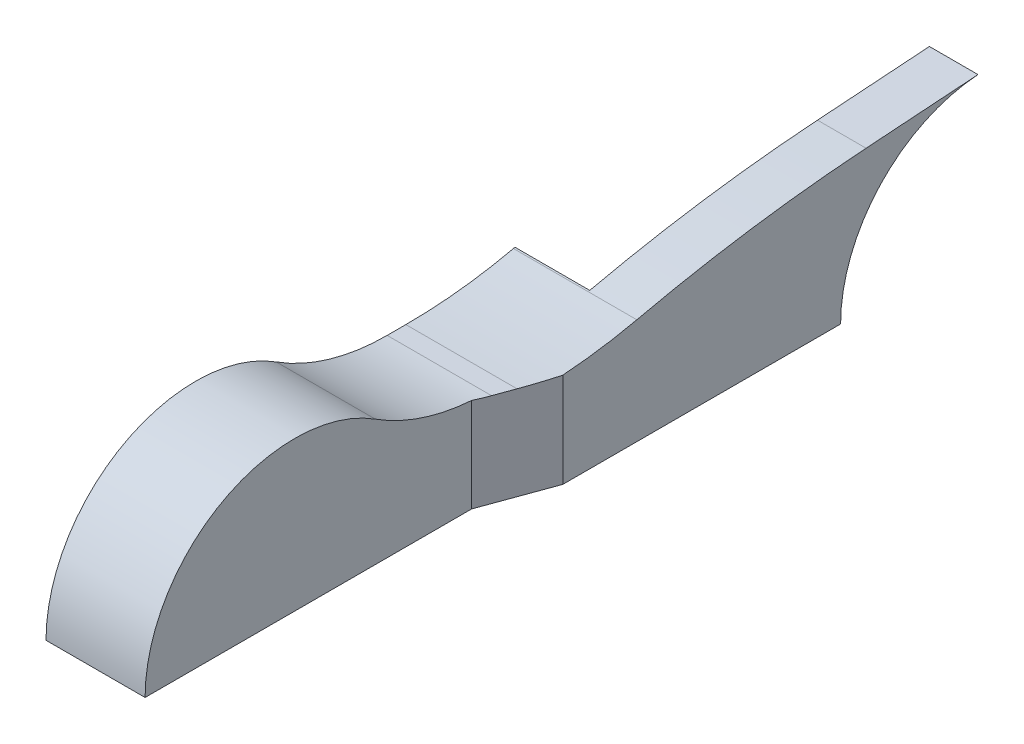
ISO-10303-21;
HEADER;
FILE_DESCRIPTION(('STEP AP214'),'2;1');
FILE_NAME('part.step','',(''),(''),'','','');
FILE_SCHEMA(('AUTOMOTIVE_DESIGN { 1 0 10303 214 1 1 1 1 }'));
ENDSEC;
DATA;
#1=APPLICATION_CONTEXT('core data for automotive mechanical design processes');
#2=APPLICATION_PROTOCOL_DEFINITION('international standard','automotive_design',2000,#1);
#3=PRODUCT_CONTEXT('',#1,'mechanical');
#4=PRODUCT('Part','Part','',(#3));
#5=PRODUCT_RELATED_PRODUCT_CATEGORY('part','',(#4));
#6=PRODUCT_DEFINITION_FORMATION('','',#4);
#7=PRODUCT_DEFINITION_CONTEXT('part definition',#1,'design');
#8=PRODUCT_DEFINITION('design','',#6,#7);
#9=PRODUCT_DEFINITION_SHAPE('','',#8);
#10=(LENGTH_UNIT() NAMED_UNIT(*) SI_UNIT(.MILLI.,.METRE.));
#11=(NAMED_UNIT(*) PLANE_ANGLE_UNIT() SI_UNIT($,.RADIAN.));
#12=(NAMED_UNIT(*) SI_UNIT($,.STERADIAN.) SOLID_ANGLE_UNIT());
#13=UNCERTAINTY_MEASURE_WITH_UNIT(LENGTH_MEASURE(1.E-05),#10,'distance_accuracy_value','');
#14=(GEOMETRIC_REPRESENTATION_CONTEXT(3) GLOBAL_UNCERTAINTY_ASSIGNED_CONTEXT((#13)) GLOBAL_UNIT_ASSIGNED_CONTEXT((#10,
#11,#12)) REPRESENTATION_CONTEXT('',''));
#15=CARTESIAN_POINT('',(0.,0.,0.));
#16=DIRECTION('',(0.,0.,1.));
#17=DIRECTION('',(1.,0.,0.));
#18=AXIS2_PLACEMENT_3D('',#15,#16,#17);
#19=CARTESIAN_POINT('',(26.5,0.,0.));
#20=DIRECTION('',(1.,0.,0.));
#21=DIRECTION('',(0.,0.,-1.));
#22=AXIS2_PLACEMENT_3D('',#19,#20,#21);
#23=PLANE('',#22);
#24=DIRECTION('',(0.,-1.,0.));
#25=VECTOR('',#24,1.);
#26=CARTESIAN_POINT('',(26.5,40.,-47.3393967735451));
#27=LINE('',#26,#25);
#28=CARTESIAN_POINT('',(26.5,25.1381171175806,-47.3393967735451));
#29=VERTEX_POINT('',#28);
#30=CARTESIAN_POINT('',(26.5,0.,-47.3393967735451));
#31=VERTEX_POINT('',#30);
#32=EDGE_CURVE('E230',#29,#31,#27,.T.);
#33=ORIENTED_EDGE('',*,*,#32,.F.);
#34=CARTESIAN_POINT('',(26.5,80.,-51.234753829798));
#35=DIRECTION('',(1.,0.,0.));
#36=DIRECTION('',(0.,0.,-1.));
#37=AXIS2_PLACEMENT_3D('',#34,#35,#36);
#38=CIRCLE('',#37,55.);
#39=CARTESIAN_POINT('',(26.5,33.6842105263158,-21.572527928336));
#40=VERTEX_POINT('',#39);
#41=EDGE_CURVE('E202',#29,#40,#38,.F.);
#42=ORIENTED_EDGE('',*,*,#41,.T.);
#43=CARTESIAN_POINT('',(26.5,0.,0.));
#44=DIRECTION('',(1.,0.,0.));
#45=DIRECTION('',(0.,0.,-1.));
#46=AXIS2_PLACEMENT_3D('',#43,#44,#45);
#47=CIRCLE('',#46,40.);
#48=CARTESIAN_POINT('',(26.5,0.,40.));
#49=VERTEX_POINT('',#48);
#50=EDGE_CURVE('E153',#40,#49,#47,.T.);
#51=ORIENTED_EDGE('',*,*,#50,.T.);
#52=DIRECTION('',(0.,0.,-1.));
#53=VECTOR('',#52,1.);
#54=CARTESIAN_POINT('',(26.5,0.,0.));
#55=LINE('',#54,#53);
#56=CARTESIAN_POINT('',(26.5,0.,0.));
#57=VERTEX_POINT('',#56);
#58=EDGE_CURVE('E248',#49,#57,#55,.T.);
#59=ORIENTED_EDGE('',*,*,#58,.T.);
#60=DIRECTION('',(0.,-1.,0.));
#61=VECTOR('',#60,1.);
#62=CARTESIAN_POINT('',(26.5,40.,0.));
#63=LINE('',#62,#61);
#64=CARTESIAN_POINT('',(26.5,-1.2E-05,0.));
#65=VERTEX_POINT('',#64);
#66=EDGE_CURVE('E268',#57,#65,#63,.T.);
#67=ORIENTED_EDGE('',*,*,#66,.T.);
#68=DIRECTION('',(0.,0.,-1.));
#69=VECTOR('',#68,1.);
#70=CARTESIAN_POINT('',(26.5,-1.2E-05,0.));
#71=LINE('',#70,#69);
#72=EDGE_CURVE('E254',#65,#31,#71,.T.);
#73=ORIENTED_EDGE('',*,*,#72,.T.);
#74=EDGE_LOOP('',(#33,#42,#51,#59,#67,#73));
#75=FACE_BOUND('',#74,.T.);
#76=ADVANCED_FACE('F134',(#75),#23,.T.);
#77=CARTESIAN_POINT('',(0.,0.,0.));
#78=DIRECTION('',(1.,0.,0.));
#79=DIRECTION('',(0.,0.,-1.));
#80=AXIS2_PLACEMENT_3D('',#77,#78,#79);
#81=PLANE('',#80);
#82=CARTESIAN_POINT('',(0.,0.,0.));
#83=DIRECTION('',(1.,0.,0.));
#84=DIRECTION('',(0.,0.,-1.));
#85=AXIS2_PLACEMENT_3D('',#82,#83,#84);
#86=CIRCLE('',#85,40.);
#87=CARTESIAN_POINT('',(0.,33.6842105263158,-21.572527928336));
#88=VERTEX_POINT('',#87);
#89=CARTESIAN_POINT('',(0.,0.,40.));
#90=VERTEX_POINT('',#89);
#91=EDGE_CURVE('E358',#88,#90,#86,.T.);
#92=ORIENTED_EDGE('',*,*,#91,.F.);
#93=CARTESIAN_POINT('',(0.,80.,-51.234753829798));
#94=DIRECTION('',(1.,0.,0.));
#95=DIRECTION('',(0.,0.,-1.));
#96=AXIS2_PLACEMENT_3D('',#93,#94,#95);
#97=CIRCLE('',#96,55.);
#98=CARTESIAN_POINT('',(0.,25.,-51.234753829798));
#99=VERTEX_POINT('',#98);
#100=EDGE_CURVE('E201',#99,#88,#97,.F.);
#101=ORIENTED_EDGE('',*,*,#100,.F.);
#102=DIRECTION('',(0.,0.,-1.));
#103=VECTOR('',#102,1.);
#104=CARTESIAN_POINT('',(0.,25.,0.));
#105=LINE('',#104,#103);
#106=CARTESIAN_POINT('',(0.,25.,-56.234753829798));
#107=VERTEX_POINT('',#106);
#108=EDGE_CURVE('E138',#99,#107,#105,.T.);
#109=ORIENTED_EDGE('',*,*,#108,.T.);
#110=CARTESIAN_POINT('',(0.,154.46555360194,-56.234753829798));
#111=DIRECTION('',(1.,0.,0.));
#112=DIRECTION('',(0.,0.,-1.));
#113=AXIS2_PLACEMENT_3D('',#110,#111,#112);
#114=CIRCLE('',#113,129.46555360194);
#115=CARTESIAN_POINT('',(0.,28.2360396908721,-84.9999999999999));
#116=VERTEX_POINT('',#115);
#117=EDGE_CURVE('E176',#107,#116,#114,.T.);
#118=ORIENTED_EDGE('',*,*,#117,.T.);
#119=CARTESIAN_POINT('',(0.,-363.981977839457,-174.378842372769));
#120=DIRECTION('',(1.,0.,0.));
#121=DIRECTION('',(0.,0.,-1.));
#122=AXIS2_PLACEMENT_3D('',#119,#120,#121);
#123=CIRCLE('',#122,402.272980374419);
#124=CARTESIAN_POINT('',(0.,28.3303792047622,-85.415));
#125=VERTEX_POINT('',#124);
#126=EDGE_CURVE('E203',#125,#116,#123,.T.);
#127=ORIENTED_EDGE('',*,*,#126,.F.);
#128=DIRECTION('',(0.,-1.,0.));
#129=VECTOR('',#128,1.);
#130=CARTESIAN_POINT('',(0.,40.,-85.415));
#131=LINE('',#130,#129);
#132=CARTESIAN_POINT('',(0.,-1.2E-05,-85.415));
#133=VERTEX_POINT('',#132);
#134=EDGE_CURVE('E274',#125,#133,#131,.T.);
#135=ORIENTED_EDGE('',*,*,#134,.T.);
#136=DIRECTION('',(0.,0.,-1.));
#137=VECTOR('',#136,1.);
#138=CARTESIAN_POINT('',(0.,-1.2E-05,0.));
#139=LINE('',#138,#137);
#140=CARTESIAN_POINT('',(0.,-1.2E-05,0.));
#141=VERTEX_POINT('',#140);
#142=EDGE_CURVE('E244',#141,#133,#139,.T.);
#143=ORIENTED_EDGE('',*,*,#142,.F.);
#144=DIRECTION('',(0.,-1.,0.));
#145=VECTOR('',#144,1.);
#146=CARTESIAN_POINT('',(0.,40.,0.));
#147=LINE('',#146,#145);
#148=CARTESIAN_POINT('',(0.,0.,0.));
#149=VERTEX_POINT('',#148);
#150=EDGE_CURVE('E271',#149,#141,#147,.T.);
#151=ORIENTED_EDGE('',*,*,#150,.F.);
#152=DIRECTION('',(0.,0.,-1.));
#153=VECTOR('',#152,1.);
#154=CARTESIAN_POINT('',(0.,0.,0.));
#155=LINE('',#154,#153);
#156=EDGE_CURVE('E242',#90,#149,#155,.T.);
#157=ORIENTED_EDGE('',*,*,#156,.F.);
#158=EDGE_LOOP('',(#92,#101,#109,#118,#127,#135,#143,#151,#157));
#159=FACE_BOUND('',#158,.T.);
#160=ADVANCED_FACE('F200',(#159),#81,.F.);
#161=CARTESIAN_POINT('',(0.,-1.2E-05,0.));
#162=DIRECTION('',(0.,1.,0.));
#163=DIRECTION('',(0.,0.,1.));
#164=AXIS2_PLACEMENT_3D('',#161,#162,#163);
#165=PLANE('',#164);
#166=DIRECTION('',(-1.,0.,0.));
#167=VECTOR('',#166,1.);
#168=CARTESIAN_POINT('',(33.000055,-1.2E-05,-139.500000000002));
#169=LINE('',#168,#167);
#170=CARTESIAN_POINT('',(33.,-1.2E-05,-139.500000000002));
#171=VERTEX_POINT('',#170);
#172=CARTESIAN_POINT('',(20.,-1.2E-05,-139.500000000002));
#173=VERTEX_POINT('',#172);
#174=EDGE_CURVE('E311',#171,#173,#169,.T.);
#175=ORIENTED_EDGE('',*,*,#174,.F.);
#176=DIRECTION('',(0.,0.,-1.));
#177=VECTOR('',#176,1.);
#178=CARTESIAN_POINT('',(33.,-1.2E-05,0.));
#179=LINE('',#178,#177);
#180=CARTESIAN_POINT('',(33.,0.,-65.198));
#181=VERTEX_POINT('',#180);
#182=EDGE_CURVE('E231',#181,#171,#179,.T.);
#183=ORIENTED_EDGE('',*,*,#182,.F.);
#184=DIRECTION('',(0.34202014332567,0.,-0.939692620785908));
#185=VECTOR('',#184,1.);
#186=CARTESIAN_POINT('',(8.18550002329151,-1.2E-05,2.97927836106343));
#187=LINE('',#186,#185);
#188=EDGE_CURVE('E255',#31,#181,#187,.T.);
#189=ORIENTED_EDGE('',*,*,#188,.F.);
#190=ORIENTED_EDGE('',*,*,#72,.F.);
#191=DIRECTION('',(1.,0.,0.));
#192=VECTOR('',#191,1.);
#193=CARTESIAN_POINT('',(0.,-1.2E-05,0.));
#194=LINE('',#193,#192);
#195=EDGE_CURVE('E247',#141,#65,#194,.T.);
#196=ORIENTED_EDGE('',*,*,#195,.F.);
#197=ORIENTED_EDGE('',*,*,#142,.T.);
#198=DIRECTION('',(1.,0.,0.));
#199=VECTOR('',#198,1.);
#200=CARTESIAN_POINT('',(0.,-1.2E-05,-85.415));
#201=LINE('',#200,#199);
#202=CARTESIAN_POINT('',(20.,-1.2E-05,-85.415));
#203=VERTEX_POINT('',#202);
#204=EDGE_CURVE('E218',#133,#203,#201,.T.);
#205=ORIENTED_EDGE('',*,*,#204,.T.);
#206=DIRECTION('',(0.,0.,-1.));
#207=VECTOR('',#206,1.);
#208=CARTESIAN_POINT('',(20.,-1.2E-05,0.));
#209=LINE('',#208,#207);
#210=EDGE_CURVE('E215',#203,#173,#209,.T.);
#211=ORIENTED_EDGE('',*,*,#210,.T.);
#212=EDGE_LOOP('',(#175,#183,#189,#190,#196,#197,#205,#211));
#213=FACE_BOUND('',#212,.T.);
#214=ADVANCED_FACE('F293',(#213),#165,.F.);
#215=CARTESIAN_POINT('',(20.,40.,0.));
#216=DIRECTION('',(-1.,0.,0.));
#217=DIRECTION('',(0.,0.,1.));
#218=AXIS2_PLACEMENT_3D('',#215,#216,#217);
#219=PLANE('',#218);
#220=DIRECTION('',(0.,-1.,0.));
#221=VECTOR('',#220,1.);
#222=CARTESIAN_POINT('',(20.,40.,-85.415));
#223=LINE('',#222,#221);
#224=CARTESIAN_POINT('',(20.,28.3303792047622,-85.415));
#225=VERTEX_POINT('',#224);
#226=EDGE_CURVE('E243',#225,#203,#223,.T.);
#227=ORIENTED_EDGE('',*,*,#226,.F.);
#228=CARTESIAN_POINT('',(20.,-363.981977839457,-174.378842372769));
#229=DIRECTION('',(-1.,0.,0.));
#230=DIRECTION('',(0.,0.,1.));
#231=AXIS2_PLACEMENT_3D('',#228,#229,#230);
#232=CIRCLE('',#231,402.272980374419);
#233=CARTESIAN_POINT('',(20.,37.3110857729395,-146.317697779313));
#234=VERTEX_POINT('',#233);
#235=EDGE_CURVE('E206',#225,#234,#232,.T.);
#236=ORIENTED_EDGE('',*,*,#235,.T.);
#237=DIRECTION('',(0.,-0.069756473744118,0.997564050259825));
#238=VECTOR('',#237,1.);
#239=CARTESIAN_POINT('',(20.,27.1424260745071,-0.899089153937633));
#240=LINE('',#239,#238);
#241=CARTESIAN_POINT('',(20.,39.4037799852631,-176.244619287107));
#242=VERTEX_POINT('',#241);
#243=EDGE_CURVE('E304',#242,#234,#240,.T.);
#244=ORIENTED_EDGE('',*,*,#243,.F.);
#245=CARTESIAN_POINT('',(20.,0.,-179.));
#246=DIRECTION('',(-1.,0.,0.));
#247=DIRECTION('',(0.,0.,1.));
#248=AXIS2_PLACEMENT_3D('',#245,#246,#247);
#249=CIRCLE('',#248,39.5);
#250=EDGE_CURVE('E301',#242,#173,#249,.F.);
#251=ORIENTED_EDGE('',*,*,#250,.T.);
#252=ORIENTED_EDGE('',*,*,#210,.F.);
#253=EDGE_LOOP('',(#227,#236,#244,#251,#252));
#254=FACE_BOUND('',#253,.T.);
#255=ADVANCED_FACE('F298',(#254),#219,.T.);
#256=CARTESIAN_POINT('',(0.,40.,-85.415));
#257=DIRECTION('',(0.,0.,-1.));
#258=DIRECTION('',(-1.,0.,0.));
#259=AXIS2_PLACEMENT_3D('',#256,#257,#258);
#260=PLANE('',#259);
#261=ORIENTED_EDGE('',*,*,#134,.F.);
#262=DIRECTION('',(1.,0.,0.));
#263=VECTOR('',#262,1.);
#264=CARTESIAN_POINT('',(-1.2E-05,28.3303792047622,-85.415));
#265=LINE('',#264,#263);
#266=EDGE_CURVE('E190',#125,#225,#265,.T.);
#267=ORIENTED_EDGE('',*,*,#266,.T.);
#268=ORIENTED_EDGE('',*,*,#226,.T.);
#269=ORIENTED_EDGE('',*,*,#204,.F.);
#270=EDGE_LOOP('',(#261,#267,#268,#269));
#271=FACE_BOUND('',#270,.T.);
#272=ADVANCED_FACE('F284',(#271),#260,.T.);
#273=CARTESIAN_POINT('',(26.5,0.,0.));
#274=DIRECTION('',(0.,1.,0.));
#275=DIRECTION('',(0.,0.,1.));
#276=AXIS2_PLACEMENT_3D('',#273,#274,#275);
#277=PLANE('',#276);
#278=DIRECTION('',(-1.,0.,0.));
#279=VECTOR('',#278,1.);
#280=CARTESIAN_POINT('',(26.5,0.,0.));
#281=LINE('',#280,#279);
#282=EDGE_CURVE('E239',#57,#149,#281,.T.);
#283=ORIENTED_EDGE('',*,*,#282,.F.);
#284=ORIENTED_EDGE('',*,*,#58,.F.);
#285=DIRECTION('',(-1.,0.,0.));
#286=VECTOR('',#285,1.);
#287=CARTESIAN_POINT('',(26.5,0.,40.));
#288=LINE('',#287,#286);
#289=EDGE_CURVE('E224',#49,#90,#288,.T.);
#290=ORIENTED_EDGE('',*,*,#289,.T.);
#291=ORIENTED_EDGE('',*,*,#156,.T.);
#292=EDGE_LOOP('',(#283,#284,#290,#291));
#293=FACE_BOUND('',#292,.T.);
#294=ADVANCED_FACE('F136',(#293),#277,.F.);
#295=CARTESIAN_POINT('',(26.5,0.,0.));
#296=DIRECTION('',(-1.,0.,0.));
#297=DIRECTION('',(0.,0.,1.));
#298=AXIS2_PLACEMENT_3D('',#295,#296,#297);
#299=CYLINDRICAL_SURFACE('',#298,40.);
#300=ORIENTED_EDGE('',*,*,#50,.F.);
#301=DIRECTION('',(1.,0.,0.));
#302=VECTOR('',#301,1.);
#303=CARTESIAN_POINT('',(-1.2E-05,33.6842105263158,-21.572527928336));
#304=LINE('',#303,#302);
#305=EDGE_CURVE('E317',#88,#40,#304,.T.);
#306=ORIENTED_EDGE('',*,*,#305,.F.);
#307=ORIENTED_EDGE('',*,*,#91,.T.);
#308=ORIENTED_EDGE('',*,*,#289,.F.);
#309=EDGE_LOOP('',(#300,#306,#307,#308));
#310=FACE_BOUND('',#309,.T.);
#311=ADVANCED_FACE('F412',(#310),#299,.T.);
#312=CARTESIAN_POINT('',(0.,40.,0.));
#313=DIRECTION('',(0.,0.,-1.));
#314=DIRECTION('',(-1.,0.,0.));
#315=AXIS2_PLACEMENT_3D('',#312,#313,#314);
#316=PLANE('',#315);
#317=ORIENTED_EDGE('',*,*,#66,.F.);
#318=ORIENTED_EDGE('',*,*,#282,.T.);
#319=ORIENTED_EDGE('',*,*,#150,.T.);
#320=ORIENTED_EDGE('',*,*,#195,.T.);
#321=EDGE_LOOP('',(#317,#318,#319,#320));
#322=FACE_BOUND('',#321,.T.);
#323=ADVANCED_FACE('F373',(#322),#316,.F.);
#324=CARTESIAN_POINT('',(8.18550002329151,40.,2.97927836106343));
#325=DIRECTION('',(-0.939692620785908,0.,-0.34202014332567));
#326=DIRECTION('',(-0.34202014332567,0.,0.939692620785908));
#327=AXIS2_PLACEMENT_3D('',#324,#325,#326);
#328=PLANE('',#327);
#329=DIRECTION('',(0.,-1.,0.));
#330=VECTOR('',#329,1.);
#331=CARTESIAN_POINT('',(33.,40.,-65.198));
#332=LINE('',#331,#330);
#333=CARTESIAN_POINT('',(33.,25.3106474328395,-65.198));
#334=VERTEX_POINT('',#333);
#335=EDGE_CURVE('E226',#334,#181,#332,.T.);
#336=ORIENTED_EDGE('',*,*,#335,.F.);
#337=CARTESIAN_POINT('',(29.7376451916459,154.46555360194,-56.234753829798));
#338=DIRECTION('',(-0.939692620785908,0.,-0.34202014332567));
#339=DIRECTION('',(0.34202014332567,0.,-0.939692620785908));
#340=AXIS2_PLACEMENT_3D('',#337,#338,#339);
#341=ELLIPSE('',#340,137.774364444473,129.46555360194);
#342=CARTESIAN_POINT('',(29.7376451916459,25.,-56.234753829798));
#343=VERTEX_POINT('',#342);
#344=EDGE_CURVE('E191',#334,#343,#341,.T.);
#345=ORIENTED_EDGE('',*,*,#344,.T.);
#346=DIRECTION('',(0.34202014332567,0.,-0.939692620785908));
#347=VECTOR('',#346,1.);
#348=CARTESIAN_POINT('',(8.18550002329151,25.,2.97927836106343));
#349=LINE('',#348,#347);
#350=CARTESIAN_POINT('',(27.9177940203149,25.,-51.234753829798));
#351=VERTEX_POINT('',#350);
#352=EDGE_CURVE('E144',#351,#343,#349,.T.);
#353=ORIENTED_EDGE('',*,*,#352,.F.);
#354=CARTESIAN_POINT('',(27.9177940203149,80.,-51.234753829798));
#355=DIRECTION('',(-0.939692620785908,0.,-0.34202014332567));
#356=DIRECTION('',(0.34202014332567,0.,-0.939692620785908));
#357=AXIS2_PLACEMENT_3D('',#354,#355,#356);
#358=ELLIPSE('',#357,58.5297774861752,55.);
#359=EDGE_CURVE('E13',#29,#351,#358,.F.);
#360=ORIENTED_EDGE('',*,*,#359,.F.);
#361=ORIENTED_EDGE('',*,*,#32,.T.);
#362=ORIENTED_EDGE('',*,*,#188,.T.);
#363=EDGE_LOOP('',(#336,#345,#353,#360,#361,#362));
#364=FACE_BOUND('',#363,.T.);
#365=ADVANCED_FACE('F385',(#364),#328,.F.);
#366=CARTESIAN_POINT('',(33.,40.,0.));
#367=DIRECTION('',(-1.,0.,0.));
#368=DIRECTION('',(0.,0.,1.));
#369=AXIS2_PLACEMENT_3D('',#366,#367,#368);
#370=PLANE('',#369);
#371=CARTESIAN_POINT('',(33.,-363.981977839457,-174.378842372769));
#372=DIRECTION('',(-1.,0.,0.));
#373=DIRECTION('',(0.,0.,1.));
#374=AXIS2_PLACEMENT_3D('',#371,#372,#373);
#375=CIRCLE('',#374,402.272980374419);
#376=CARTESIAN_POINT('',(32.9999999999999,28.2360396908721,-84.9999999999999));
#377=VERTEX_POINT('',#376);
#378=CARTESIAN_POINT('',(33.,37.3110857729395,-146.317697779313));
#379=VERTEX_POINT('',#378);
#380=EDGE_CURVE('E349',#377,#379,#375,.T.);
#381=ORIENTED_EDGE('',*,*,#380,.F.);
#382=CARTESIAN_POINT('',(33.,154.46555360194,-56.234753829798));
#383=DIRECTION('',(-1.,0.,0.));
#384=DIRECTION('',(0.,0.,1.));
#385=AXIS2_PLACEMENT_3D('',#382,#383,#384);
#386=CIRCLE('',#385,129.46555360194);
#387=EDGE_CURVE('E350',#377,#334,#386,.T.);
#388=ORIENTED_EDGE('',*,*,#387,.T.);
#389=ORIENTED_EDGE('',*,*,#335,.T.);
#390=ORIENTED_EDGE('',*,*,#182,.T.);
#391=CARTESIAN_POINT('',(33.,0.,-179.));
#392=DIRECTION('',(-1.,0.,0.));
#393=DIRECTION('',(0.,0.,1.));
#394=AXIS2_PLACEMENT_3D('',#391,#392,#393);
#395=CIRCLE('',#394,39.5);
#396=CARTESIAN_POINT('',(33.,39.4037799852631,-176.244619287107));
#397=VERTEX_POINT('',#396);
#398=EDGE_CURVE('E344',#397,#171,#395,.F.);
#399=ORIENTED_EDGE('',*,*,#398,.F.);
#400=DIRECTION('',(0.,-0.069756473744118,0.997564050259825));
#401=VECTOR('',#400,1.);
#402=CARTESIAN_POINT('',(33.,27.1424260745071,-0.899089153937629));
#403=LINE('',#402,#401);
#404=EDGE_CURVE('E232',#397,#379,#403,.T.);
#405=ORIENTED_EDGE('',*,*,#404,.T.);
#406=EDGE_LOOP('',(#381,#388,#389,#390,#399,#405));
#407=FACE_BOUND('',#406,.T.);
#408=ADVANCED_FACE('F347',(#407),#370,.F.);
#409=CARTESIAN_POINT('',(-1.2E-05,80.,-51.234753829798));
#410=DIRECTION('',(1.,0.,0.));
#411=DIRECTION('',(0.,0.,-1.));
#412=AXIS2_PLACEMENT_3D('',#409,#410,#411);
#413=CYLINDRICAL_SURFACE('',#412,55.);
#414=ORIENTED_EDGE('',*,*,#100,.T.);
#415=ORIENTED_EDGE('',*,*,#305,.T.);
#416=ORIENTED_EDGE('',*,*,#41,.F.);
#417=ORIENTED_EDGE('',*,*,#359,.T.);
#418=DIRECTION('',(-1.,0.,0.));
#419=VECTOR('',#418,1.);
#420=CARTESIAN_POINT('',(33.000055,25.,-51.234753829798));
#421=LINE('',#420,#419);
#422=EDGE_CURVE('E166',#351,#99,#421,.T.);
#423=ORIENTED_EDGE('',*,*,#422,.T.);
#424=EDGE_LOOP('',(#414,#415,#416,#417,#423));
#425=FACE_BOUND('',#424,.T.);
#426=ADVANCED_FACE('F403',(#425),#413,.F.);
#427=CARTESIAN_POINT('',(33.000055,25.,0.));
#428=DIRECTION('',(0.,1.,0.));
#429=DIRECTION('',(0.,0.,1.));
#430=AXIS2_PLACEMENT_3D('',#427,#428,#429);
#431=PLANE('',#430);
#432=ORIENTED_EDGE('',*,*,#108,.F.);
#433=ORIENTED_EDGE('',*,*,#422,.F.);
#434=ORIENTED_EDGE('',*,*,#352,.T.);
#435=DIRECTION('',(-1.,0.,0.));
#436=VECTOR('',#435,1.);
#437=CARTESIAN_POINT('',(33.000055,25.,-56.234753829798));
#438=LINE('',#437,#436);
#439=EDGE_CURVE('E181',#343,#107,#438,.T.);
#440=ORIENTED_EDGE('',*,*,#439,.T.);
#441=EDGE_LOOP('',(#432,#433,#434,#440));
#442=FACE_BOUND('',#441,.T.);
#443=ADVANCED_FACE('F195',(#442),#431,.T.);
#444=CARTESIAN_POINT('',(-1.2E-05,-363.981977839457,-174.378842372769));
#445=DIRECTION('',(1.,0.,0.));
#446=DIRECTION('',(0.,0.,-1.));
#447=AXIS2_PLACEMENT_3D('',#444,#445,#446);
#448=CYLINDRICAL_SURFACE('',#447,402.272980374419);
#449=ORIENTED_EDGE('',*,*,#126,.T.);
#450=DIRECTION('',(1.,0.,0.));
#451=VECTOR('',#450,1.);
#452=CARTESIAN_POINT('',(-1.2E-05,28.2360396908721,-84.9999999999999));
#453=LINE('',#452,#451);
#454=EDGE_CURVE('E186',#116,#377,#453,.T.);
#455=ORIENTED_EDGE('',*,*,#454,.T.);
#456=ORIENTED_EDGE('',*,*,#380,.T.);
#457=DIRECTION('',(-1.,0.,0.));
#458=VECTOR('',#457,1.);
#459=CARTESIAN_POINT('',(33.000055,37.3110857729395,-146.317697779313));
#460=LINE('',#459,#458);
#461=EDGE_CURVE('E198',#379,#234,#460,.T.);
#462=ORIENTED_EDGE('',*,*,#461,.T.);
#463=ORIENTED_EDGE('',*,*,#235,.F.);
#464=ORIENTED_EDGE('',*,*,#266,.F.);
#465=EDGE_LOOP('',(#449,#455,#456,#462,#463,#464));
#466=FACE_BOUND('',#465,.T.);
#467=ADVANCED_FACE('F420',(#466),#448,.T.);
#468=CARTESIAN_POINT('',(-1.2E-05,154.46555360194,-56.234753829798));
#469=DIRECTION('',(1.,0.,0.));
#470=DIRECTION('',(0.,0.,-1.));
#471=AXIS2_PLACEMENT_3D('',#468,#469,#470);
#472=CYLINDRICAL_SURFACE('',#471,129.46555360194);
#473=ORIENTED_EDGE('',*,*,#439,.F.);
#474=ORIENTED_EDGE('',*,*,#344,.F.);
#475=ORIENTED_EDGE('',*,*,#387,.F.);
#476=ORIENTED_EDGE('',*,*,#454,.F.);
#477=ORIENTED_EDGE('',*,*,#117,.F.);
#478=EDGE_LOOP('',(#473,#474,#475,#476,#477));
#479=FACE_BOUND('',#478,.T.);
#480=ADVANCED_FACE('F178',(#479),#472,.F.);
#481=CARTESIAN_POINT('',(33.000055,26.9477874493385,1.88437286526339));
#482=DIRECTION('',(0.,-0.997564050259825,-0.069756473744118));
#483=DIRECTION('',(0.,0.069756473744118,-0.997564050259825));
#484=AXIS2_PLACEMENT_3D('',#481,#482,#483);
#485=PLANE('',#484);
#486=ORIENTED_EDGE('',*,*,#243,.T.);
#487=ORIENTED_EDGE('',*,*,#461,.F.);
#488=ORIENTED_EDGE('',*,*,#404,.F.);
#489=DIRECTION('',(-1.,0.,0.));
#490=VECTOR('',#489,1.);
#491=CARTESIAN_POINT('',(33.000055,39.4037799852631,-176.244619287107));
#492=LINE('',#491,#490);
#493=EDGE_CURVE('E321',#397,#242,#492,.T.);
#494=ORIENTED_EDGE('',*,*,#493,.T.);
#495=EDGE_LOOP('',(#486,#487,#488,#494));
#496=FACE_BOUND('',#495,.T.);
#497=ADVANCED_FACE('F334',(#496),#485,.F.);
#498=CARTESIAN_POINT('',(33.000055,0.,-179.));
#499=DIRECTION('',(-1.,0.,0.));
#500=DIRECTION('',(0.,0.,1.));
#501=AXIS2_PLACEMENT_3D('',#498,#499,#500);
#502=CYLINDRICAL_SURFACE('',#501,39.5);
#503=ORIENTED_EDGE('',*,*,#493,.F.);
#504=ORIENTED_EDGE('',*,*,#398,.T.);
#505=ORIENTED_EDGE('',*,*,#174,.T.);
#506=ORIENTED_EDGE('',*,*,#250,.F.);
#507=EDGE_LOOP('',(#503,#504,#505,#506));
#508=FACE_BOUND('',#507,.T.);
#509=ADVANCED_FACE('F343',(#508),#502,.F.);
#510=CLOSED_SHELL('',(#76,#160,#214,#255,#272,#294,#311,#323,#365,#408,#426,#443,#467,#480,#497,#509));
#511=MANIFOLD_SOLID_BREP('B2',#510);
#512=ADVANCED_BREP_SHAPE_REPRESENTATION('',(#18,#511),#14);
#513=SHAPE_DEFINITION_REPRESENTATION(#9,#512);
ENDSEC;
END-ISO-10303-21;
